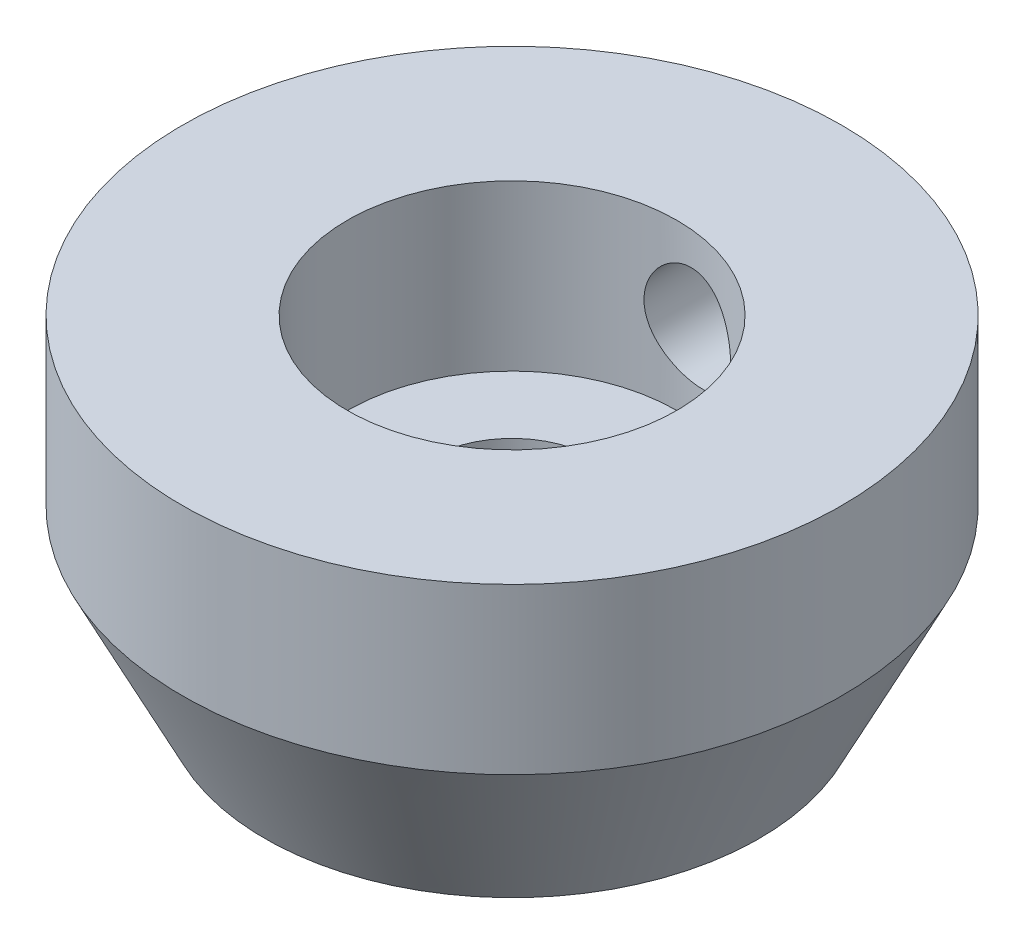
ISO-10303-21;
HEADER;
FILE_DESCRIPTION(('STEP AP214'),'2;1');
FILE_NAME('part.step','',(''),(''),'','','');
FILE_SCHEMA(('AUTOMOTIVE_DESIGN { 1 0 10303 214 1 1 1 1 }'));
ENDSEC;
DATA;
#1=APPLICATION_CONTEXT('core data for automotive mechanical design processes');
#2=APPLICATION_PROTOCOL_DEFINITION('international standard','automotive_design',2000,#1);
#3=PRODUCT_CONTEXT('',#1,'mechanical');
#4=PRODUCT('Part','Part','',(#3));
#5=PRODUCT_RELATED_PRODUCT_CATEGORY('part','',(#4));
#6=PRODUCT_DEFINITION_FORMATION('','',#4);
#7=PRODUCT_DEFINITION_CONTEXT('part definition',#1,'design');
#8=PRODUCT_DEFINITION('design','',#6,#7);
#9=PRODUCT_DEFINITION_SHAPE('','',#8);
#10=(LENGTH_UNIT() NAMED_UNIT(*) SI_UNIT(.MILLI.,.METRE.));
#11=(NAMED_UNIT(*) PLANE_ANGLE_UNIT() SI_UNIT($,.RADIAN.));
#12=(NAMED_UNIT(*) SI_UNIT($,.STERADIAN.) SOLID_ANGLE_UNIT());
#13=UNCERTAINTY_MEASURE_WITH_UNIT(LENGTH_MEASURE(1.E-05),#10,'distance_accuracy_value','');
#14=(GEOMETRIC_REPRESENTATION_CONTEXT(3) GLOBAL_UNCERTAINTY_ASSIGNED_CONTEXT((#13)) GLOBAL_UNIT_ASSIGNED_CONTEXT((#10,
#11,#12)) REPRESENTATION_CONTEXT('',''));
#15=CARTESIAN_POINT('',(0.,0.,0.));
#16=DIRECTION('',(0.,0.,1.));
#17=DIRECTION('',(1.,0.,0.));
#18=AXIS2_PLACEMENT_3D('',#15,#16,#17);
#19=CARTESIAN_POINT('',(-1.17283950617284,0.,0.));
#20=DIRECTION('',(0.,-1.,0.));
#21=DIRECTION('',(0.,0.,-1.));
#22=AXIS2_PLACEMENT_3D('',#19,#20,#21);
#23=CYLINDRICAL_SURFACE('',#22,10.);
#24=CARTESIAN_POINT('',(-1.17283950617284,13.0698821844828,-10.));
#25=CARTESIAN_POINT('',(-1.3267568361431,13.0045028317867,-9.99999941555559));
#26=CARTESIAN_POINT('',(-1.47521813468479,12.9262069768199,-9.99641868498265));
#27=CARTESIAN_POINT('',(-1.75691852872696,12.7461034441109,-9.98392648034363));
#28=CARTESIAN_POINT('',(-1.89014978676311,12.644283741558,-9.97501227621995));
#29=CARTESIAN_POINT('',(-2.13756165480331,12.4201948955123,-9.95413137997987));
#30=CARTESIAN_POINT('',(-2.25176338367653,12.2979487271779,-9.94216810952014));
#31=CARTESIAN_POINT('',(-2.45827583367672,12.0362601044117,-9.91758518251302));
#32=CARTESIAN_POINT('',(-2.55058736441534,11.8968182862532,-9.9049655502623));
#33=CARTESIAN_POINT('',(-2.71195582516007,11.6024171356972,-9.88118883637991));
#34=CARTESIAN_POINT('',(-2.78067496313782,11.4472705341802,-9.87005429201789));
#35=CARTESIAN_POINT('',(-2.8910565215389,11.1274254749468,-9.85144096085811));
#36=CARTESIAN_POINT('',(-2.93272121121303,10.9627278196085,-9.84396186746446));
#37=CARTESIAN_POINT('',(-2.98746875263802,10.6299293292177,-9.83401748291775));
#38=CARTESIAN_POINT('',(-3.00079064010638,10.4618691205737,-9.8315102725294));
#39=CARTESIAN_POINT('',(-2.99913676600776,10.1259000594446,-9.831817743768));
#40=CARTESIAN_POINT('',(-2.98416270378694,9.95799119847595,-9.83463210580174));
#41=CARTESIAN_POINT('',(-2.92674529520819,9.62916148266421,-9.8450310733093));
#42=CARTESIAN_POINT('',(-2.88462933887758,9.46818142232804,-9.85255879508389));
#43=CARTESIAN_POINT('',(-2.77449918911401,9.15554683435271,-9.8710578190007));
#44=CARTESIAN_POINT('',(-2.70648248702348,9.00389321169353,-9.88202945469054));
#45=CARTESIAN_POINT('',(-2.54555124164211,8.7123314154422,-9.9056713339291));
#46=CARTESIAN_POINT('',(-2.45236537742901,8.57257446062528,-9.91835928756799));
#47=CARTESIAN_POINT('',(-2.24397061804243,8.31048557892155,-9.94302061796697));
#48=CARTESIAN_POINT('',(-2.12875993586075,8.18815506735515,-9.95499393664083));
#49=CARTESIAN_POINT('',(-1.87817268416111,7.9632030576148,-9.97589257881856));
#50=CARTESIAN_POINT('',(-1.74261199142773,7.86078345207253,-9.98478732828528));
#51=CARTESIAN_POINT('',(-1.45598012940177,7.68018210342341,-9.99701787691052));
#52=CARTESIAN_POINT('',(-1.30491164285689,7.601996177422,-10.0003546358506));
#53=CARTESIAN_POINT('',(-0.994888396860318,7.47354334643514,-9.99959300651745));
#54=CARTESIAN_POINT('',(-0.83615194599337,7.42274905826322,-9.99564206811025));
#55=CARTESIAN_POINT('',(-0.512877395826936,7.34815825055206,-9.97950973227759));
#56=CARTESIAN_POINT('',(-0.348340273644808,7.32435720622092,-9.96732971481296));
#57=CARTESIAN_POINT('',(-0.0221390130837282,7.30437448179393,-9.93489626892606));
#58=CARTESIAN_POINT('',(0.139507384713648,7.30758881241475,-9.91482890649873));
#59=CARTESIAN_POINT('',(0.459107371522267,7.33963145543597,-9.86726234309724));
#60=CARTESIAN_POINT('',(0.617060611981128,7.36846217552259,-9.83976244370748));
#61=CARTESIAN_POINT('',(0.928256587095734,7.45123567480379,-9.77809060599087));
#62=CARTESIAN_POINT('',(1.08134827599021,7.50565525225427,-9.74379946900627));
#63=CARTESIAN_POINT('',(1.37595875981842,7.6379058205147,-9.67091981924018));
#64=CARTESIAN_POINT('',(1.51747415467863,7.71574365832418,-9.63233005171175));
#65=CARTESIAN_POINT('',(1.7930635926626,7.8975005915734,-9.55118548274323));
#66=CARTESIAN_POINT('',(1.92633624728577,8.00259084548118,-9.50852899287891));
#67=CARTESIAN_POINT('',(2.17354359704464,8.23394142652329,-9.42437281978939));
#68=CARTESIAN_POINT('',(2.28747193874618,8.36020868205715,-9.38287352035693));
#69=CARTESIAN_POINT('',(2.49548016724773,8.63445386217845,-9.30355542303677));
#70=CARTESIAN_POINT('',(2.58900621288072,8.78288739848467,-9.26585152059014));
#71=CARTESIAN_POINT('',(2.74931110646703,9.09535141945596,-9.19914781169718));
#72=CARTESIAN_POINT('',(2.81610373290375,9.25937381549212,-9.17014352338079));
#73=CARTESIAN_POINT('',(2.91709652392948,9.58858364511388,-9.1255312937513));
#74=CARTESIAN_POINT('',(2.95293079052192,9.7531770429504,-9.10925668565782));
#75=CARTESIAN_POINT('',(2.99650041367095,10.0867598854011,-9.08940113445449));
#76=CARTESIAN_POINT('',(3.0042524028657,10.2557466681302,-9.08581267759115));
#77=CARTESIAN_POINT('',(2.99180881892323,10.579287127272,-9.09151870175041));
#78=CARTESIAN_POINT('',(2.97373060560339,10.7339452779346,-9.09983723733612));
#79=CARTESIAN_POINT('',(2.91416796350726,11.0377434718354,-9.1267422609645));
#80=CARTESIAN_POINT('',(2.87268158137552,11.1868830534553,-9.14532960591194));
#81=CARTESIAN_POINT('',(2.76756997903734,11.476754588322,-9.19110714321844));
#82=CARTESIAN_POINT('',(2.70380858120771,11.6174284386064,-9.21835015679561));
#83=CARTESIAN_POINT('',(2.55623720385307,11.8863617654746,-9.27902669233785));
#84=CARTESIAN_POINT('',(2.47242081056269,12.0146172520863,-9.31246219394097));
#85=CARTESIAN_POINT('',(2.27954532247558,12.2658568169974,-9.38575940358492));
#86=CARTESIAN_POINT('',(2.16901590002709,12.3876256013967,-9.42592003962934));
#87=CARTESIAN_POINT('',(1.92980441888543,12.6114013820567,-9.50734244640029));
#88=CARTESIAN_POINT('',(1.80111557174588,12.7134009540928,-9.54860462421214));
#89=CARTESIAN_POINT('',(1.52058499216284,12.9005210322407,-9.63161619987956));
#90=CARTESIAN_POINT('',(1.36783944237481,12.9843405611721,-9.6732582011632));
#91=CARTESIAN_POINT('',(1.04902451158991,13.1246433658841,-9.75142157738891));
#92=CARTESIAN_POINT('',(0.882956093444221,13.1811286150575,-9.78794332185161));
#93=CARTESIAN_POINT('',(0.545529020064938,13.2636284674144,-9.85272107379377));
#94=CARTESIAN_POINT('',(0.374345644663791,13.2902370655783,-9.88112951680258));
#95=CARTESIAN_POINT('',(0.0287821175564634,13.3134889063753,-9.92907142638012));
#96=CARTESIAN_POINT('',(-0.145595618175545,13.310153932286,-9.94861133373987));
#97=CARTESIAN_POINT('',(-0.465145869904365,13.2760246302035,-9.97601364590383));
#98=CARTESIAN_POINT('',(-0.610679715328363,13.2495389858147,-9.98521114667435));
#99=CARTESIAN_POINT('',(-0.896509390522003,13.1753590187372,-9.99720449000409));
#100=CARTESIAN_POINT('',(-1.03680537071217,13.1276653056084,-10.0000005165396));
#101=CARTESIAN_POINT('',(-1.17283950617284,13.0698821844828,-10.));
#102=B_SPLINE_CURVE_WITH_KNOTS('',3,(#24,#25,#26,#27,#28,#29,#30,#31,#32,#33,#34,#35,#36,#37,
#38,#39,#40,#41,#42,#43,#44,#45,#46,#47,#48,#49,#50,#51,#52,#53,#54,#55,#56,#57,#58,#59,#60,#61,
#62,#63,#64,#65,#66,#67,#68,#69,#70,#71,#72,#73,#74,#75,#76,#77,#78,#79,#80,#81,#82,#83,#84,#85,
#86,#87,#88,#89,#90,#91,#92,#93,#94,#95,#96,#97,#98,#99,#100,#101),.UNSPECIFIED.,.T.,.F.,(4,2,2,
2,2,2,2,2,2,2,2,2,2,2,2,2,2,2,2,2,2,2,2,2,2,2,2,2,2,2,2,2,2,2,2,2,2,2,4),(0.,0.501132601004172,
1.00252193764552,1.50335107463867,2.00416168551488,2.51186987023236,3.01953546431679,
3.52290228519711,4.02623887675839,4.52361497616695,5.02103926198,5.5240559219036,
6.02711341198059,6.53503244794393,7.04286376481195,7.54053277827157,8.03811835671616,
8.5246093977469,9.01114616894183,9.50713138652999,10.0032617607714,10.5258960687221,
11.0487016997104,11.5842989730136,12.1196198413212,12.6245700332935,13.1292211032207,
13.5947997505513,14.0604172550488,14.5289326035811,14.9975979882166,15.5032587501643,
16.0091090439775,16.543925301416,17.0787029421419,17.6026489280176,18.1262137858332,
18.569134017356,19.0120415193372),.UNSPECIFIED.);
#103=CARTESIAN_POINT('',(-1.17283950617284,13.0698821844828,-10.));
#104=VERTEX_POINT('',#103);
#105=EDGE_CURVE('E82',#104,#104,#102,.T.);
#106=ORIENTED_EDGE('',*,*,#105,.F.);
#107=EDGE_LOOP('',(#106));
#108=FACE_BOUND('',#107,.T.);
#109=CARTESIAN_POINT('',(-1.17283950617284,5.30864197530864,0.));
#110=DIRECTION('',(0.,-1.,0.));
#111=DIRECTION('',(0.,0.,-1.));
#112=AXIS2_PLACEMENT_3D('',#109,#110,#111);
#113=CIRCLE('',#112,10.);
#114=CARTESIAN_POINT('',(-1.17283950617284,5.30864197530864,-10.));
#115=VERTEX_POINT('',#114);
#116=EDGE_CURVE('E78',#115,#115,#113,.T.);
#117=ORIENTED_EDGE('',*,*,#116,.T.);
#118=EDGE_LOOP('',(#117));
#119=FACE_BOUND('',#118,.T.);
#120=CARTESIAN_POINT('',(-1.17283950617284,15.3086419753086,0.));
#121=DIRECTION('',(0.,-1.,0.));
#122=DIRECTION('',(0.,0.,-1.));
#123=AXIS2_PLACEMENT_3D('',#120,#121,#122);
#124=CIRCLE('',#123,10.);
#125=CARTESIAN_POINT('',(-1.17283950617284,15.3086419753086,-10.));
#126=VERTEX_POINT('',#125);
#127=EDGE_CURVE('E10',#126,#126,#124,.T.);
#128=ORIENTED_EDGE('',*,*,#127,.F.);
#129=EDGE_LOOP('',(#128));
#130=FACE_BOUND('',#129,.T.);
#131=ADVANCED_FACE('F41',(#108,#119,#130),#23,.F.);
#132=CARTESIAN_POINT('',(8.82716049382716,15.3086419753086,0.));
#133=DIRECTION('',(0.,1.,0.));
#134=DIRECTION('',(0.,0.,1.));
#135=AXIS2_PLACEMENT_3D('',#132,#133,#134);
#136=PLANE('',#135);
#137=ORIENTED_EDGE('',*,*,#127,.T.);
#138=EDGE_LOOP('',(#137));
#139=FACE_BOUND('',#138,.T.);
#140=CARTESIAN_POINT('',(-1.17283950617284,15.3086419753086,0.));
#141=DIRECTION('',(0.,-1.,0.));
#142=DIRECTION('',(0.,0.,-1.));
#143=AXIS2_PLACEMENT_3D('',#140,#141,#142);
#144=CIRCLE('',#143,20.);
#145=CARTESIAN_POINT('',(-1.17283950617284,15.3086419753086,-20.));
#146=VERTEX_POINT('',#145);
#147=EDGE_CURVE('E55',#146,#146,#144,.T.);
#148=ORIENTED_EDGE('',*,*,#147,.F.);
#149=EDGE_LOOP('',(#148));
#150=FACE_BOUND('',#149,.T.);
#151=ADVANCED_FACE('F112',(#139,#150),#136,.T.);
#152=CARTESIAN_POINT('',(-1.17283950617284,0.,0.));
#153=DIRECTION('',(0.,-1.,0.));
#154=DIRECTION('',(0.,0.,-1.));
#155=AXIS2_PLACEMENT_3D('',#152,#153,#154);
#156=CYLINDRICAL_SURFACE('',#155,20.);
#157=CARTESIAN_POINT('',(-1.17283950617284,13.0698821844828,-20.));
#158=CARTESIAN_POINT('',(-1.01903212598856,13.1352047161623,-19.9999976010928));
#159=CARTESIAN_POINT('',(-0.859666799340379,13.1876835763562,-19.998208566949));
#160=CARTESIAN_POINT('',(-0.534419942707593,13.2653969968429,-19.9904707337189));
#161=CARTESIAN_POINT('',(-0.368532744047512,13.2906072879318,-19.9845182368682));
#162=CARTESIAN_POINT('',(-0.0351616374936672,13.3130804965972,-19.9683126480118));
#163=CARTESIAN_POINT('',(0.13232141448698,13.3103576361747,-19.9580617470634));
#164=CARTESIAN_POINT('',(0.464187489741249,13.2772007742862,-19.9335856275471));
#165=CARTESIAN_POINT('',(0.628570958744817,13.2467707886963,-19.9193609851413));
#166=CARTESIAN_POINT('',(0.950391772352959,13.1590256795523,-19.8876382454953));
#167=CARTESIAN_POINT('',(1.10779780013446,13.1016005994906,-19.870126937885));
#168=CARTESIAN_POINT('',(1.41069563708818,12.9615249581023,-19.8330193655752));
#169=CARTESIAN_POINT('',(1.5561860749464,12.8788714985095,-19.8134228614945));
#170=CARTESIAN_POINT('',(1.83325931260387,12.6893381308599,-19.773296532454));
#171=CARTESIAN_POINT('',(1.96462550291193,12.5821433472917,-19.7527576264703));
#172=CARTESIAN_POINT('',(2.20754583079456,12.3470991330818,-19.7126402161798));
#173=CARTESIAN_POINT('',(2.31909905589733,12.2192487516791,-19.6930617561357));
#174=CARTESIAN_POINT('',(2.51966980003926,11.9457550927326,-19.6564453473612));
#175=CARTESIAN_POINT('',(2.60858925957625,11.8000383141799,-19.6394185803118));
#176=CARTESIAN_POINT('',(2.76058384265519,11.4953009383168,-19.6095439140585));
#177=CARTESIAN_POINT('',(2.82366164802405,11.3362817235866,-19.5966955812485));
#178=CARTESIAN_POINT('',(2.92123719942755,11.0119394289485,-19.5765420927316));
#179=CARTESIAN_POINT('',(2.95614381550262,10.8467443548907,-19.5691577699507));
#180=CARTESIAN_POINT('',(2.99778012638066,10.5126916664619,-19.560327160068));
#181=CARTESIAN_POINT('',(3.00451320181837,10.3438344939623,-19.5588801605279));
#182=CARTESIAN_POINT('',(2.98971770522278,10.0103824834739,-19.562033720949));
#183=CARTESIAN_POINT('',(2.96867928239955,9.84576462915439,-19.5665293983778));
#184=CARTESIAN_POINT('',(2.89987032643223,9.52246948709206,-19.5809666673894));
#185=CARTESIAN_POINT('',(2.85209953182167,9.36379225747002,-19.5909083122385));
#186=CARTESIAN_POINT('',(2.73116620753136,9.05641549242485,-19.6153645918665));
#187=CARTESIAN_POINT('',(2.65794799969278,8.90773869608749,-19.6298892476587));
#188=CARTESIAN_POINT('',(2.48828004229161,8.62468918958394,-19.6622388278786));
#189=CARTESIAN_POINT('',(2.39182779966146,8.49031801667805,-19.6800641064237));
#190=CARTESIAN_POINT('',(2.17633262595902,8.23698908779559,-19.7178905005906));
#191=CARTESIAN_POINT('',(2.05689859198391,8.11836912304935,-19.7379262605232));
#192=CARTESIAN_POINT('',(1.79993140217392,7.90273571912633,-19.7782588036772));
#193=CARTESIAN_POINT('',(1.66239678046705,7.80572403160604,-19.798555607919));
#194=CARTESIAN_POINT('',(1.37113418546363,7.63491100363053,-19.838095391258));
#195=CARTESIAN_POINT('',(1.21722819878776,7.56140911381281,-19.8573223808857));
#196=CARTESIAN_POINT('',(0.898917776071874,7.44143575409223,-19.8930501681909));
#197=CARTESIAN_POINT('',(0.734513786016587,7.39496313675654,-19.9095510815732));
#198=CARTESIAN_POINT('',(0.40100479997805,7.33075065964837,-19.9386767927398));
#199=CARTESIAN_POINT('',(0.231938933688725,7.31281934798743,-19.9513269534981));
#200=CARTESIAN_POINT('',(-0.107057451267653,7.30576435871372,-19.972304279685));
#201=CARTESIAN_POINT('',(-0.276987896832991,7.31663828467759,-19.9806318046621));
#202=CARTESIAN_POINT('',(-0.610489174029191,7.36664284933781,-19.9927800034091));
#203=CARTESIAN_POINT('',(-0.774114454108459,7.40539691626918,-19.9966589701863));
#204=CARTESIAN_POINT('',(-1.09264472743556,7.50967604577992,-20.0004738745599));
#205=CARTESIAN_POINT('',(-1.24754983346608,7.57520076202959,-20.0004098631648));
#206=CARTESIAN_POINT('',(-1.54381833717039,7.73093793243939,-19.997107074424));
#207=CARTESIAN_POINT('',(-1.68521768384593,7.82108223509651,-19.9938769983404));
#208=CARTESIAN_POINT('',(-1.95101744770526,8.02359298776335,-19.9852983923393));
#209=CARTESIAN_POINT('',(-2.07541717181117,8.13596034335441,-19.9799497760832));
#210=CARTESIAN_POINT('',(-2.30456257115854,8.38061894426326,-19.9682870008079));
#211=CARTESIAN_POINT('',(-2.40916868989329,8.51304061122238,-19.9619665168632));
#212=CARTESIAN_POINT('',(-2.59475017353436,8.79353404858233,-19.9496077557859));
#213=CARTESIAN_POINT('',(-2.67572506851157,8.94160613012662,-19.9435694842674));
#214=CARTESIAN_POINT('',(-2.81200706040334,9.24981788323555,-19.9328333432693));
#215=CARTESIAN_POINT('',(-2.86722043463463,9.40999919189993,-19.9281403916835));
#216=CARTESIAN_POINT('',(-2.94994911651637,9.73740775255699,-19.9209342962207));
#217=CARTESIAN_POINT('',(-2.97746512728926,9.90463482557434,-19.9184210970089));
#218=CARTESIAN_POINT('',(-3.00395236652508,10.2407963154747,-19.9160037848005));
#219=CARTESIAN_POINT('',(-3.00301761451494,10.4097232649857,-19.9160910780923));
#220=CARTESIAN_POINT('',(-2.97286332564635,10.7450055563651,-19.9188387453174));
#221=CARTESIAN_POINT('',(-2.94364478877832,10.9113609889397,-19.9214990282812));
#222=CARTESIAN_POINT('',(-2.85784959967672,11.2364989758503,-19.9289381105064));
#223=CARTESIAN_POINT('',(-2.80132009066113,11.3952940635998,-19.9337132579861));
#224=CARTESIAN_POINT('',(-2.66251785027902,11.7011984210982,-19.9445651011594));
#225=CARTESIAN_POINT('',(-2.58023929484182,11.8483050376317,-19.9506420912132));
#226=CARTESIAN_POINT('',(-2.39188700933189,12.1272464062495,-19.9630369497833));
#227=CARTESIAN_POINT('',(-2.28571856764808,12.2590171144752,-19.9693556916159));
#228=CARTESIAN_POINT('',(-2.05280987899892,12.5028019118238,-19.9809703567478));
#229=CARTESIAN_POINT('',(-1.92608948323291,12.6148348500118,-19.9862672563447));
#230=CARTESIAN_POINT('',(-1.69543073088495,12.7864863740007,-19.9933999662852));
#231=CARTESIAN_POINT('',(-1.59571805853019,12.8518387769825,-19.9957952937585));
#232=CARTESIAN_POINT('',(-1.38922418212129,12.9702621560056,-19.9990961616926));
#233=CARTESIAN_POINT('',(-1.28244301277104,13.0233331923384,-20.000001709467));
#234=CARTESIAN_POINT('',(-1.17283950617284,13.0698821844828,-20.));
#235=B_SPLINE_CURVE_WITH_KNOTS('',3,(#157,#158,#159,#160,#161,#162,#163,#164,#165,#166,#167,
#168,#169,#170,#171,#172,#173,#174,#175,#176,#177,#178,#179,#180,#181,#182,#183,#184,#185,#186,
#187,#188,#189,#190,#191,#192,#193,#194,#195,#196,#197,#198,#199,#200,#201,#202,#203,#204,#205,
#206,#207,#208,#209,#210,#211,#212,#213,#214,#215,#216,#217,#218,#219,#220,#221,#222,#223,#224,
#225,#226,#227,#228,#229,#230,#231,#232,#233,#234),.UNSPECIFIED.,.T.,.F.,(4,2,2,2,2,2,2,2,2,2,2,
2,2,2,2,2,2,2,2,2,2,2,2,2,2,2,2,2,2,2,2,2,2,2,2,2,2,2,4),(0.,0.500880784521368,1.00220699032083,
1.50327796148325,2.00427631888051,2.50733326445878,3.01044802358117,3.52042078918945,
4.03041703513848,4.54258658104878,5.05470296092628,5.55924573649071,6.06372796859049,
6.559424379075,7.05512563799789,7.55191837576637,8.04876444434969,8.55496400703154,
9.06120458942543,9.57365781768257,10.0860892899497,10.5950687199352,11.1040058072086,
11.6061948198545,12.1083773359281,12.6091835677978,13.110010211546,13.6142461536112,
14.118492122199,14.6245585466434,15.1306121238131,15.6349935582552,16.1393571606363,
16.6428532425701,17.146463290618,17.6521062255167,18.1572636355879,18.5141942316261,
18.8711230753879),.UNSPECIFIED.);
#236=CARTESIAN_POINT('',(-1.17283950617284,13.0698821844828,-20.));
#237=VERTEX_POINT('',#236);
#238=EDGE_CURVE('E45',#237,#237,#235,.T.);
#239=ORIENTED_EDGE('',*,*,#238,.F.);
#240=EDGE_LOOP('',(#239));
#241=FACE_BOUND('',#240,.T.);
#242=ORIENTED_EDGE('',*,*,#147,.T.);
#243=EDGE_LOOP('',(#242));
#244=FACE_BOUND('',#243,.T.);
#245=CARTESIAN_POINT('',(-1.17283950617284,5.30864197530864,0.));
#246=DIRECTION('',(0.,-1.,0.));
#247=DIRECTION('',(0.,0.,-1.));
#248=AXIS2_PLACEMENT_3D('',#245,#246,#247);
#249=CIRCLE('',#248,20.);
#250=CARTESIAN_POINT('',(-1.17283950617284,5.30864197530864,-20.));
#251=VERTEX_POINT('',#250);
#252=EDGE_CURVE('E60',#251,#251,#249,.T.);
#253=ORIENTED_EDGE('',*,*,#252,.F.);
#254=EDGE_LOOP('',(#253));
#255=FACE_BOUND('',#254,.T.);
#256=ADVANCED_FACE('F108',(#241,#244,#255),#156,.T.);
#257=CARTESIAN_POINT('',(-1.17283950617284,-4.69135802469136,0.));
#258=DIRECTION('',(0.,1.,0.));
#259=DIRECTION('',(0.,0.,1.));
#260=AXIS2_PLACEMENT_3D('',#257,#258,#259);
#261=CONICAL_SURFACE('',#260,15.,0.463647609000806);
#262=ORIENTED_EDGE('',*,*,#252,.T.);
#263=EDGE_LOOP('',(#262));
#264=FACE_BOUND('',#263,.T.);
#265=CARTESIAN_POINT('',(-1.17283950617284,-4.69135802469136,0.));
#266=DIRECTION('',(0.,-1.,0.));
#267=DIRECTION('',(0.,0.,-1.));
#268=AXIS2_PLACEMENT_3D('',#265,#266,#267);
#269=CIRCLE('',#268,15.);
#270=CARTESIAN_POINT('',(-1.17283950617284,-4.69135802469136,-15.));
#271=VERTEX_POINT('',#270);
#272=EDGE_CURVE('E66',#271,#271,#269,.T.);
#273=ORIENTED_EDGE('',*,*,#272,.F.);
#274=EDGE_LOOP('',(#273));
#275=FACE_BOUND('',#274,.T.);
#276=ADVANCED_FACE('F105',(#264,#275),#261,.T.);
#277=CARTESIAN_POINT('',(13.8271604938272,-4.69135802469136,0.));
#278=DIRECTION('',(0.,-1.,0.));
#279=DIRECTION('',(0.,0.,-1.));
#280=AXIS2_PLACEMENT_3D('',#277,#278,#279);
#281=PLANE('',#280);
#282=ORIENTED_EDGE('',*,*,#272,.T.);
#283=EDGE_LOOP('',(#282));
#284=FACE_BOUND('',#283,.T.);
#285=CARTESIAN_POINT('',(-1.17283950617284,-4.69135802469136,0.));
#286=DIRECTION('',(0.,-1.,0.));
#287=DIRECTION('',(0.,0.,-1.));
#288=AXIS2_PLACEMENT_3D('',#285,#286,#287);
#289=CIRCLE('',#288,5.);
#290=CARTESIAN_POINT('',(-1.17283950617284,-4.69135802469136,-5.));
#291=VERTEX_POINT('',#290);
#292=EDGE_CURVE('E70',#291,#291,#289,.T.);
#293=ORIENTED_EDGE('',*,*,#292,.F.);
#294=EDGE_LOOP('',(#293));
#295=FACE_BOUND('',#294,.T.);
#296=ADVANCED_FACE('F101',(#284,#295),#281,.T.);
#297=CARTESIAN_POINT('',(-1.17283950617284,0.,0.));
#298=DIRECTION('',(0.,-1.,0.));
#299=DIRECTION('',(0.,0.,-1.));
#300=AXIS2_PLACEMENT_3D('',#297,#298,#299);
#301=CYLINDRICAL_SURFACE('',#300,5.);
#302=ORIENTED_EDGE('',*,*,#292,.T.);
#303=EDGE_LOOP('',(#302));
#304=FACE_BOUND('',#303,.T.);
#305=CARTESIAN_POINT('',(-1.17283950617284,5.30864197530864,0.));
#306=DIRECTION('',(0.,-1.,0.));
#307=DIRECTION('',(0.,0.,-1.));
#308=AXIS2_PLACEMENT_3D('',#305,#306,#307);
#309=CIRCLE('',#308,5.);
#310=CARTESIAN_POINT('',(-1.17283950617284,5.30864197530864,-5.));
#311=VERTEX_POINT('',#310);
#312=EDGE_CURVE('E74',#311,#311,#309,.T.);
#313=ORIENTED_EDGE('',*,*,#312,.F.);
#314=EDGE_LOOP('',(#313));
#315=FACE_BOUND('',#314,.T.);
#316=ADVANCED_FACE('F97',(#304,#315),#301,.F.);
#317=CARTESIAN_POINT('',(8.82716049382717,5.30864197530864,0.));
#318=DIRECTION('',(0.,1.,0.));
#319=DIRECTION('',(0.,0.,1.));
#320=AXIS2_PLACEMENT_3D('',#317,#318,#319);
#321=PLANE('',#320);
#322=ORIENTED_EDGE('',*,*,#312,.T.);
#323=EDGE_LOOP('',(#322));
#324=FACE_BOUND('',#323,.T.);
#325=ORIENTED_EDGE('',*,*,#116,.F.);
#326=EDGE_LOOP('',(#325));
#327=FACE_BOUND('',#326,.T.);
#328=ADVANCED_FACE('F92',(#324,#327),#321,.T.);
#329=CARTESIAN_POINT('',(0.,10.3086419753086,-23.));
#330=DIRECTION('',(0.,0.,1.));
#331=DIRECTION('',(1.,0.,0.));
#332=AXIS2_PLACEMENT_3D('',#329,#330,#331);
#333=CYLINDRICAL_SURFACE('',#332,3.);
#334=ORIENTED_EDGE('',*,*,#105,.T.);
#335=EDGE_LOOP('',(#334));
#336=FACE_BOUND('',#335,.T.);
#337=ORIENTED_EDGE('',*,*,#238,.T.);
#338=EDGE_LOOP('',(#337));
#339=FACE_BOUND('',#338,.T.);
#340=ADVANCED_FACE('F88',(#336,#339),#333,.F.);
#341=CLOSED_SHELL('',(#131,#151,#256,#276,#296,#316,#328,#340));
#342=MANIFOLD_SOLID_BREP('B2',#341);
#343=ADVANCED_BREP_SHAPE_REPRESENTATION('',(#18,#342),#14);
#344=SHAPE_DEFINITION_REPRESENTATION(#9,#343);
ENDSEC;
END-ISO-10303-21;
